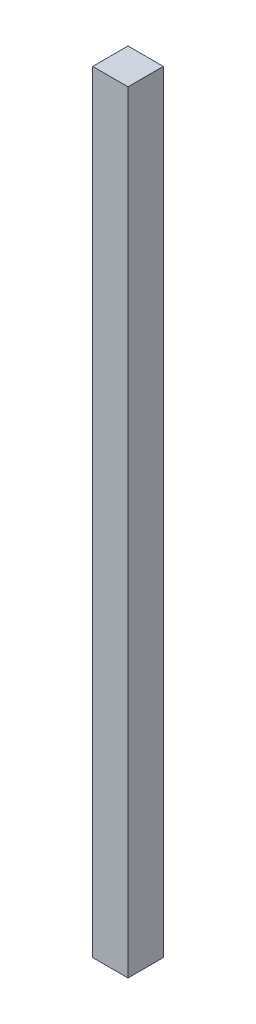
ISO-10303-21;
HEADER;
FILE_DESCRIPTION(('STEP AP214'),'2;1');
FILE_NAME('part.step','',(''),(''),'','','');
FILE_SCHEMA(('AUTOMOTIVE_DESIGN { 1 0 10303 214 1 1 1 1 }'));
ENDSEC;
DATA;
#1=APPLICATION_CONTEXT('core data for automotive mechanical design processes');
#2=APPLICATION_PROTOCOL_DEFINITION('international standard','automotive_design',2000,#1);
#3=PRODUCT_CONTEXT('',#1,'mechanical');
#4=PRODUCT('Part','Part','',(#3));
#5=PRODUCT_RELATED_PRODUCT_CATEGORY('part','',(#4));
#6=PRODUCT_DEFINITION_FORMATION('','',#4);
#7=PRODUCT_DEFINITION_CONTEXT('part definition',#1,'design');
#8=PRODUCT_DEFINITION('design','',#6,#7);
#9=PRODUCT_DEFINITION_SHAPE('','',#8);
#10=(LENGTH_UNIT() NAMED_UNIT(*) SI_UNIT(.MILLI.,.METRE.));
#11=(NAMED_UNIT(*) PLANE_ANGLE_UNIT() SI_UNIT($,.RADIAN.));
#12=(NAMED_UNIT(*) SI_UNIT($,.STERADIAN.) SOLID_ANGLE_UNIT());
#13=UNCERTAINTY_MEASURE_WITH_UNIT(LENGTH_MEASURE(1.E-05),#10,'distance_accuracy_value','');
#14=(GEOMETRIC_REPRESENTATION_CONTEXT(3) GLOBAL_UNCERTAINTY_ASSIGNED_CONTEXT((#13)) GLOBAL_UNIT_ASSIGNED_CONTEXT((#10,
#11,#12)) REPRESENTATION_CONTEXT('',''));
#15=CARTESIAN_POINT('',(0.,0.,0.));
#16=DIRECTION('',(0.,0.,1.));
#17=DIRECTION('',(1.,0.,0.));
#18=AXIS2_PLACEMENT_3D('',#15,#16,#17);
#19=CARTESIAN_POINT('',(-41.9695541077134,555.,-20.0363125542474));
#20=DIRECTION('',(1.,0.,0.));
#21=DIRECTION('',(0.,0.,-1.));
#22=AXIS2_PLACEMENT_3D('',#19,#20,#21);
#23=PLANE('',#22);
#24=DIRECTION('',(0.,0.,1.));
#25=VECTOR('',#24,1.);
#26=CARTESIAN_POINT('',(-41.9695541077134,0.,-20.0363125542474));
#27=LINE('',#26,#25);
#28=CARTESIAN_POINT('',(-41.9695541077134,0.,-20.0363125542474));
#29=VERTEX_POINT('',#28);
#30=CARTESIAN_POINT('',(-41.9695541077134,0.,5.36368744575261));
#31=VERTEX_POINT('',#30);
#32=EDGE_CURVE('E94',#29,#31,#27,.T.);
#33=ORIENTED_EDGE('',*,*,#32,.T.);
#34=DIRECTION('',(0.,-1.,0.));
#35=VECTOR('',#34,1.);
#36=CARTESIAN_POINT('',(-41.9695541077134,555.,5.36368744575261));
#37=LINE('',#36,#35);
#38=CARTESIAN_POINT('',(-41.9695541077134,555.,5.36368744575261));
#39=VERTEX_POINT('',#38);
#40=EDGE_CURVE('E11',#39,#31,#37,.T.);
#41=ORIENTED_EDGE('',*,*,#40,.F.);
#42=DIRECTION('',(0.,0.,1.));
#43=VECTOR('',#42,1.);
#44=CARTESIAN_POINT('',(-41.9695541077134,555.,-20.0363125542474));
#45=LINE('',#44,#43);
#46=CARTESIAN_POINT('',(-41.9695541077134,555.,-20.0363125542474));
#47=VERTEX_POINT('',#46);
#48=EDGE_CURVE('E82',#47,#39,#45,.T.);
#49=ORIENTED_EDGE('',*,*,#48,.F.);
#50=DIRECTION('',(0.,-1.,0.));
#51=VECTOR('',#50,1.);
#52=CARTESIAN_POINT('',(-41.9695541077134,555.,-20.0363125542474));
#53=LINE('',#52,#51);
#54=EDGE_CURVE('E90',#47,#29,#53,.T.);
#55=ORIENTED_EDGE('',*,*,#54,.T.);
#56=EDGE_LOOP('',(#33,#41,#49,#55));
#57=FACE_BOUND('',#56,.T.);
#58=ADVANCED_FACE('F31',(#57),#23,.F.);
#59=CARTESIAN_POINT('',(-41.9695541077134,555.,5.36368744575261));
#60=DIRECTION('',(0.,0.,-1.));
#61=DIRECTION('',(-1.,0.,0.));
#62=AXIS2_PLACEMENT_3D('',#59,#60,#61);
#63=PLANE('',#62);
#64=DIRECTION('',(1.,0.,0.));
#65=VECTOR('',#64,1.);
#66=CARTESIAN_POINT('',(-41.9695541077134,0.,5.36368744575261));
#67=LINE('',#66,#65);
#68=CARTESIAN_POINT('',(-16.5695541077134,0.,5.36368744575261));
#69=VERTEX_POINT('',#68);
#70=EDGE_CURVE('E86',#31,#69,#67,.T.);
#71=ORIENTED_EDGE('',*,*,#70,.T.);
#72=DIRECTION('',(0.,-1.,0.));
#73=VECTOR('',#72,1.);
#74=CARTESIAN_POINT('',(-16.5695541077134,555.,5.36368744575261));
#75=LINE('',#74,#73);
#76=CARTESIAN_POINT('',(-16.5695541077134,555.,5.36368744575261));
#77=VERTEX_POINT('',#76);
#78=EDGE_CURVE('E39',#77,#69,#75,.T.);
#79=ORIENTED_EDGE('',*,*,#78,.F.);
#80=DIRECTION('',(1.,0.,0.));
#81=VECTOR('',#80,1.);
#82=CARTESIAN_POINT('',(-41.9695541077134,555.,5.36368744575261));
#83=LINE('',#82,#81);
#84=EDGE_CURVE('E77',#39,#77,#83,.T.);
#85=ORIENTED_EDGE('',*,*,#84,.F.);
#86=ORIENTED_EDGE('',*,*,#40,.T.);
#87=EDGE_LOOP('',(#71,#79,#85,#86));
#88=FACE_BOUND('',#87,.T.);
#89=ADVANCED_FACE('F85',(#88),#63,.F.);
#90=CARTESIAN_POINT('',(-16.5695541077134,555.,-20.0363125542474));
#91=DIRECTION('',(-1.,0.,0.));
#92=DIRECTION('',(0.,0.,1.));
#93=AXIS2_PLACEMENT_3D('',#90,#91,#92);
#94=PLANE('',#93);
#95=DIRECTION('',(0.,0.,-1.));
#96=VECTOR('',#95,1.);
#97=CARTESIAN_POINT('',(-16.5695541077134,0.,-20.0363125542474));
#98=LINE('',#97,#96);
#99=CARTESIAN_POINT('',(-16.5695541077134,0.,-20.0363125542474));
#100=VERTEX_POINT('',#99);
#101=EDGE_CURVE('E64',#69,#100,#98,.T.);
#102=ORIENTED_EDGE('',*,*,#101,.T.);
#103=DIRECTION('',(0.,-1.,0.));
#104=VECTOR('',#103,1.);
#105=CARTESIAN_POINT('',(-16.5695541077134,555.,-20.0363125542474));
#106=LINE('',#105,#104);
#107=CARTESIAN_POINT('',(-16.5695541077134,555.,-20.0363125542474));
#108=VERTEX_POINT('',#107);
#109=EDGE_CURVE('E87',#108,#100,#106,.T.);
#110=ORIENTED_EDGE('',*,*,#109,.F.);
#111=DIRECTION('',(0.,0.,-1.));
#112=VECTOR('',#111,1.);
#113=CARTESIAN_POINT('',(-16.5695541077134,555.,-20.0363125542474));
#114=LINE('',#113,#112);
#115=EDGE_CURVE('E80',#77,#108,#114,.T.);
#116=ORIENTED_EDGE('',*,*,#115,.F.);
#117=ORIENTED_EDGE('',*,*,#78,.T.);
#118=EDGE_LOOP('',(#102,#110,#116,#117));
#119=FACE_BOUND('',#118,.T.);
#120=ADVANCED_FACE('F88',(#119),#94,.F.);
#121=CARTESIAN_POINT('',(-41.9695541077134,555.,-20.0363125542474));
#122=DIRECTION('',(0.,0.,1.));
#123=DIRECTION('',(1.,0.,0.));
#124=AXIS2_PLACEMENT_3D('',#121,#122,#123);
#125=PLANE('',#124);
#126=DIRECTION('',(-1.,0.,0.));
#127=VECTOR('',#126,1.);
#128=CARTESIAN_POINT('',(-41.9695541077134,0.,-20.0363125542474));
#129=LINE('',#128,#127);
#130=EDGE_CURVE('E70',#100,#29,#129,.T.);
#131=ORIENTED_EDGE('',*,*,#130,.T.);
#132=ORIENTED_EDGE('',*,*,#54,.F.);
#133=DIRECTION('',(-1.,0.,0.));
#134=VECTOR('',#133,1.);
#135=CARTESIAN_POINT('',(-41.9695541077134,555.,-20.0363125542474));
#136=LINE('',#135,#134);
#137=EDGE_CURVE('E47',#108,#47,#136,.T.);
#138=ORIENTED_EDGE('',*,*,#137,.F.);
#139=ORIENTED_EDGE('',*,*,#109,.T.);
#140=EDGE_LOOP('',(#131,#132,#138,#139));
#141=FACE_BOUND('',#140,.T.);
#142=ADVANCED_FACE('F101',(#141),#125,.F.);
#143=CARTESIAN_POINT('',(-41.9695541077134,555.,5.36368744575261));
#144=DIRECTION('',(0.,1.,0.));
#145=DIRECTION('',(0.,0.,1.));
#146=AXIS2_PLACEMENT_3D('',#143,#144,#145);
#147=PLANE('',#146);
#148=ORIENTED_EDGE('',*,*,#48,.T.);
#149=ORIENTED_EDGE('',*,*,#84,.T.);
#150=ORIENTED_EDGE('',*,*,#115,.T.);
#151=ORIENTED_EDGE('',*,*,#137,.T.);
#152=EDGE_LOOP('',(#148,#149,#150,#151));
#153=FACE_BOUND('',#152,.T.);
#154=ADVANCED_FACE('F78',(#153),#147,.T.);
#155=CARTESIAN_POINT('',(-41.9695541077134,0.,5.36368744575261));
#156=DIRECTION('',(0.,1.,0.));
#157=DIRECTION('',(0.,0.,1.));
#158=AXIS2_PLACEMENT_3D('',#155,#156,#157);
#159=PLANE('',#158);
#160=ORIENTED_EDGE('',*,*,#32,.F.);
#161=ORIENTED_EDGE('',*,*,#130,.F.);
#162=ORIENTED_EDGE('',*,*,#101,.F.);
#163=ORIENTED_EDGE('',*,*,#70,.F.);
#164=EDGE_LOOP('',(#160,#161,#162,#163));
#165=FACE_BOUND('',#164,.T.);
#166=ADVANCED_FACE('F104',(#165),#159,.F.);
#167=CLOSED_SHELL('',(#58,#89,#120,#142,#154,#166));
#168=MANIFOLD_SOLID_BREP('B2',#167);
#169=ADVANCED_BREP_SHAPE_REPRESENTATION('',(#18,#168),#14);
#170=SHAPE_DEFINITION_REPRESENTATION(#9,#169);
ENDSEC;
END-ISO-10303-21;
